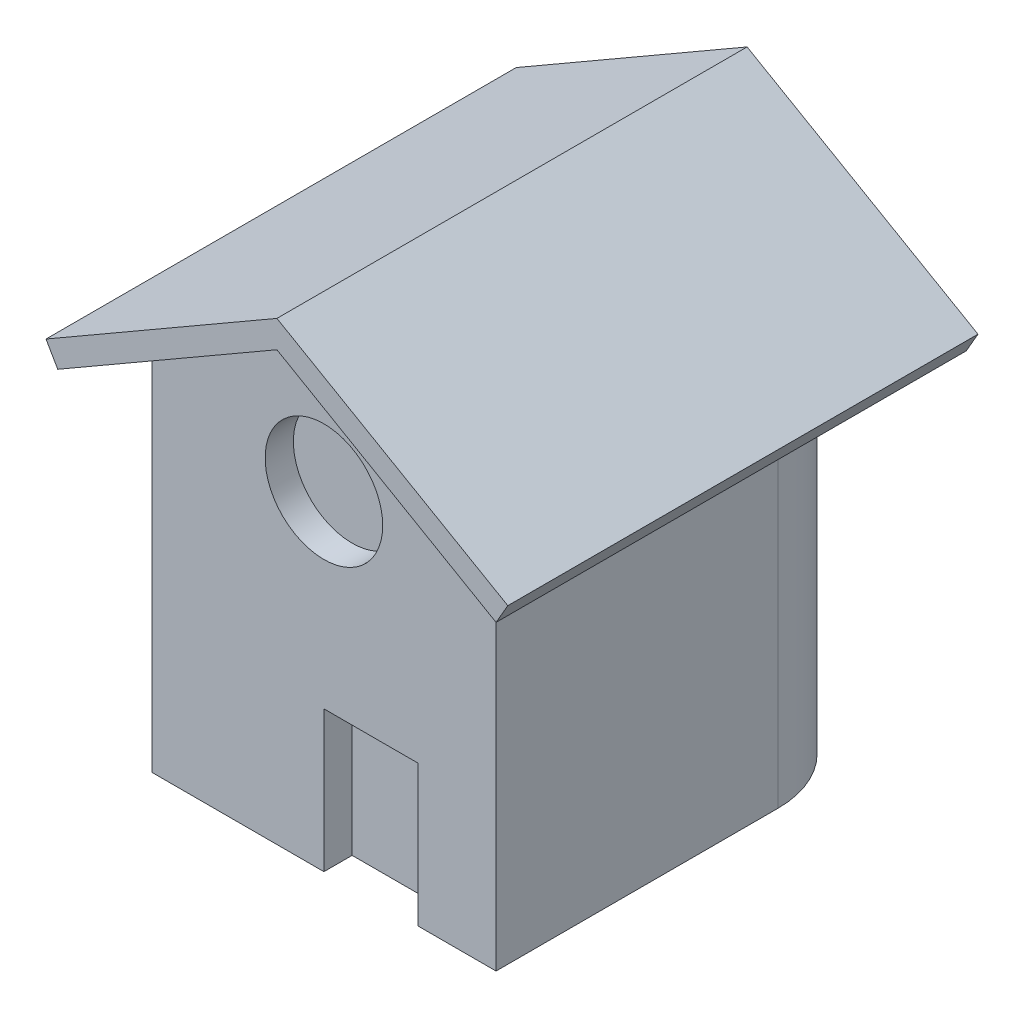
ISO-10303-21;
HEADER;
FILE_DESCRIPTION(('STEP AP214'),'2;1');
FILE_NAME('part.step','',(''),(''),'','','');
FILE_SCHEMA(('AUTOMOTIVE_DESIGN { 1 0 10303 214 1 1 1 1 }'));
ENDSEC;
DATA;
#1=APPLICATION_CONTEXT('core data for automotive mechanical design processes');
#2=APPLICATION_PROTOCOL_DEFINITION('international standard','automotive_design',2000,#1);
#3=PRODUCT_CONTEXT('',#1,'mechanical');
#4=PRODUCT('Part','Part','',(#3));
#5=PRODUCT_RELATED_PRODUCT_CATEGORY('part','',(#4));
#6=PRODUCT_DEFINITION_FORMATION('','',#4);
#7=PRODUCT_DEFINITION_CONTEXT('part definition',#1,'design');
#8=PRODUCT_DEFINITION('design','',#6,#7);
#9=PRODUCT_DEFINITION_SHAPE('','',#8);
#10=(LENGTH_UNIT() NAMED_UNIT(*) SI_UNIT(.MILLI.,.METRE.));
#11=(NAMED_UNIT(*) PLANE_ANGLE_UNIT() SI_UNIT($,.RADIAN.));
#12=(NAMED_UNIT(*) SI_UNIT($,.STERADIAN.) SOLID_ANGLE_UNIT());
#13=UNCERTAINTY_MEASURE_WITH_UNIT(LENGTH_MEASURE(1.E-05),#10,'distance_accuracy_value','');
#14=(GEOMETRIC_REPRESENTATION_CONTEXT(3) GLOBAL_UNCERTAINTY_ASSIGNED_CONTEXT((#13)) GLOBAL_UNIT_ASSIGNED_CONTEXT((#10,
#11,#12)) REPRESENTATION_CONTEXT('',''));
#15=CARTESIAN_POINT('',(0.,0.,0.));
#16=DIRECTION('',(0.,0.,1.));
#17=DIRECTION('',(1.,0.,0.));
#18=AXIS2_PLACEMENT_3D('',#15,#16,#17);
#19=CARTESIAN_POINT('',(-18.305,40.,20.));
#20=DIRECTION('',(1.,0.,0.));
#21=DIRECTION('',(0.,0.,-1.));
#22=AXIS2_PLACEMENT_3D('',#19,#20,#21);
#23=PLANE('',#22);
#24=DIRECTION('',(0.,0.,-1.));
#25=VECTOR('',#24,1.);
#26=CARTESIAN_POINT('',(-18.305,40.,20.));
#27=LINE('',#26,#25);
#28=CARTESIAN_POINT('',(-18.305,40.,20.));
#29=VERTEX_POINT('',#28);
#30=CARTESIAN_POINT('',(-18.305,40.,-10.));
#31=VERTEX_POINT('',#30);
#32=EDGE_CURVE('E234',#29,#31,#27,.T.);
#33=ORIENTED_EDGE('',*,*,#32,.T.);
#34=DIRECTION('',(0.,-1.,0.));
#35=VECTOR('',#34,1.);
#36=CARTESIAN_POINT('',(-18.305,40.,-10.));
#37=LINE('',#36,#35);
#38=CARTESIAN_POINT('',(-18.305,0.,-10.));
#39=VERTEX_POINT('',#38);
#40=EDGE_CURVE('E252',#31,#39,#37,.T.);
#41=ORIENTED_EDGE('',*,*,#40,.T.);
#42=DIRECTION('',(0.,0.,-1.));
#43=VECTOR('',#42,1.);
#44=CARTESIAN_POINT('',(-18.305,0.,20.));
#45=LINE('',#44,#43);
#46=CARTESIAN_POINT('',(-18.305,0.,20.));
#47=VERTEX_POINT('',#46);
#48=EDGE_CURVE('E249',#47,#39,#45,.T.);
#49=ORIENTED_EDGE('',*,*,#48,.F.);
#50=DIRECTION('',(0.,-1.,0.));
#51=VECTOR('',#50,1.);
#52=CARTESIAN_POINT('',(-18.305,40.,20.));
#53=LINE('',#52,#51);
#54=EDGE_CURVE('E221',#29,#47,#53,.T.);
#55=ORIENTED_EDGE('',*,*,#54,.F.);
#56=EDGE_LOOP('',(#33,#41,#49,#55));
#57=FACE_BOUND('',#56,.T.);
#58=ADVANCED_FACE('F35',(#57),#23,.F.);
#59=CARTESIAN_POINT('',(-18.305,0.,20.));
#60=DIRECTION('',(0.,1.,0.));
#61=DIRECTION('',(0.,0.,1.));
#62=AXIS2_PLACEMENT_3D('',#59,#60,#61);
#63=PLANE('',#62);
#64=ORIENTED_EDGE('',*,*,#48,.T.);
#65=CARTESIAN_POINT('',(-8.305,0.,-10.));
#66=DIRECTION('',(0.,1.,0.));
#67=DIRECTION('',(0.,0.,1.));
#68=AXIS2_PLACEMENT_3D('',#65,#66,#67);
#69=CIRCLE('',#68,10.);
#70=CARTESIAN_POINT('',(-8.305,0.,-20.));
#71=VERTEX_POINT('',#70);
#72=EDGE_CURVE('E257',#39,#71,#69,.F.);
#73=ORIENTED_EDGE('',*,*,#72,.T.);
#74=DIRECTION('',(1.,0.,0.));
#75=VECTOR('',#74,1.);
#76=CARTESIAN_POINT('',(-18.305,0.,-20.));
#77=LINE('',#76,#75);
#78=CARTESIAN_POINT('',(8.305,0.,-20.));
#79=VERTEX_POINT('',#78);
#80=EDGE_CURVE('E211',#71,#79,#77,.T.);
#81=ORIENTED_EDGE('',*,*,#80,.T.);
#82=CARTESIAN_POINT('',(8.30499999999999,0.,-10.));
#83=DIRECTION('',(0.,1.,0.));
#84=DIRECTION('',(0.,0.,1.));
#85=AXIS2_PLACEMENT_3D('',#82,#83,#84);
#86=CIRCLE('',#85,10.);
#87=CARTESIAN_POINT('',(18.305,0.,-10.));
#88=VERTEX_POINT('',#87);
#89=EDGE_CURVE('E255',#79,#88,#86,.F.);
#90=ORIENTED_EDGE('',*,*,#89,.T.);
#91=DIRECTION('',(0.,0.,-1.));
#92=VECTOR('',#91,1.);
#93=CARTESIAN_POINT('',(18.305,0.,20.));
#94=LINE('',#93,#92);
#95=CARTESIAN_POINT('',(18.305,0.,20.));
#96=VERTEX_POINT('',#95);
#97=EDGE_CURVE('E246',#96,#88,#94,.T.);
#98=ORIENTED_EDGE('',*,*,#97,.F.);
#99=DIRECTION('',(1.,0.,0.));
#100=VECTOR('',#99,1.);
#101=CARTESIAN_POINT('',(-18.305,0.,20.));
#102=LINE('',#101,#100);
#103=CARTESIAN_POINT('',(10.,0.,20.));
#104=VERTEX_POINT('',#103);
#105=EDGE_CURVE('E224',#104,#96,#102,.T.);
#106=ORIENTED_EDGE('',*,*,#105,.F.);
#107=DIRECTION('',(0.,0.,1.));
#108=VECTOR('',#107,1.);
#109=CARTESIAN_POINT('',(10.,0.,17.));
#110=LINE('',#109,#108);
#111=CARTESIAN_POINT('',(10.,0.,17.));
#112=VERTEX_POINT('',#111);
#113=EDGE_CURVE('E209',#112,#104,#110,.T.);
#114=ORIENTED_EDGE('',*,*,#113,.F.);
#115=DIRECTION('',(1.,0.,0.));
#116=VECTOR('',#115,1.);
#117=CARTESIAN_POINT('',(10.,0.,17.));
#118=LINE('',#117,#116);
#119=CARTESIAN_POINT('',(0.,0.,17.));
#120=VERTEX_POINT('',#119);
#121=EDGE_CURVE('E199',#120,#112,#118,.T.);
#122=ORIENTED_EDGE('',*,*,#121,.F.);
#123=DIRECTION('',(0.,0.,1.));
#124=VECTOR('',#123,1.);
#125=CARTESIAN_POINT('',(0.,0.,17.));
#126=LINE('',#125,#124);
#127=CARTESIAN_POINT('',(0.,0.,20.));
#128=VERTEX_POINT('',#127);
#129=EDGE_CURVE('E212',#120,#128,#126,.T.);
#130=ORIENTED_EDGE('',*,*,#129,.T.);
#131=EDGE_CURVE('E226',#47,#128,#102,.T.);
#132=ORIENTED_EDGE('',*,*,#131,.F.);
#133=EDGE_LOOP('',(#64,#73,#81,#90,#98,#106,#114,#122,#130,#132));
#134=FACE_BOUND('',#133,.T.);
#135=ADVANCED_FACE('F279',(#134),#63,.F.);
#136=CARTESIAN_POINT('',(18.305,0.,20.));
#137=DIRECTION('',(-1.,0.,0.));
#138=DIRECTION('',(0.,-1.,0.));
#139=AXIS2_PLACEMENT_3D('',#136,#137,#138);
#140=PLANE('',#139);
#141=ORIENTED_EDGE('',*,*,#97,.T.);
#142=DIRECTION('',(0.,1.,0.));
#143=VECTOR('',#142,1.);
#144=CARTESIAN_POINT('',(18.305,0.,-10.));
#145=LINE('',#144,#143);
#146=CARTESIAN_POINT('',(18.305,40.,-10.));
#147=VERTEX_POINT('',#146);
#148=EDGE_CURVE('E43',#88,#147,#145,.T.);
#149=ORIENTED_EDGE('',*,*,#148,.T.);
#150=DIRECTION('',(0.,0.,-1.));
#151=VECTOR('',#150,1.);
#152=CARTESIAN_POINT('',(18.305,40.,20.));
#153=LINE('',#152,#151);
#154=CARTESIAN_POINT('',(18.305,40.,20.));
#155=VERTEX_POINT('',#154);
#156=EDGE_CURVE('E243',#155,#147,#153,.T.);
#157=ORIENTED_EDGE('',*,*,#156,.F.);
#158=DIRECTION('',(0.,1.,0.));
#159=VECTOR('',#158,1.);
#160=CARTESIAN_POINT('',(18.305,0.,20.));
#161=LINE('',#160,#159);
#162=EDGE_CURVE('E229',#96,#155,#161,.T.);
#163=ORIENTED_EDGE('',*,*,#162,.F.);
#164=EDGE_LOOP('',(#141,#149,#157,#163));
#165=FACE_BOUND('',#164,.T.);
#166=ADVANCED_FACE('F266',(#165),#140,.F.);
#167=CARTESIAN_POINT('',(0.,0.,20.));
#168=DIRECTION('',(0.,0.,1.));
#169=DIRECTION('',(1.,0.,0.));
#170=AXIS2_PLACEMENT_3D('',#167,#168,#169);
#171=PLANE('',#170);
#172=DIRECTION('',(0.,1.,0.));
#173=VECTOR('',#172,1.);
#174=CARTESIAN_POINT('',(10.,0.,20.));
#175=LINE('',#174,#173);
#176=CARTESIAN_POINT('',(10.,15.,20.));
#177=VERTEX_POINT('',#176);
#178=EDGE_CURVE('E203',#104,#177,#175,.T.);
#179=ORIENTED_EDGE('',*,*,#178,.F.);
#180=ORIENTED_EDGE('',*,*,#105,.T.);
#181=ORIENTED_EDGE('',*,*,#162,.T.);
#182=DIRECTION('',(-0.866025403784438,0.500000000000001,0.));
#183=VECTOR('',#182,1.);
#184=CARTESIAN_POINT('',(18.305,40.,20.));
#185=LINE('',#184,#183);
#186=CARTESIAN_POINT('',(0.,50.5683966775161,20.));
#187=VERTEX_POINT('',#186);
#188=EDGE_CURVE('E231',#155,#187,#185,.T.);
#189=ORIENTED_EDGE('',*,*,#188,.T.);
#190=DIRECTION('',(-0.866025403784438,-0.500000000000001,0.));
#191=VECTOR('',#190,1.);
#192=CARTESIAN_POINT('',(0.,50.5683966775161,20.));
#193=LINE('',#192,#191);
#194=EDGE_CURVE('E179',#187,#29,#193,.T.);
#195=ORIENTED_EDGE('',*,*,#194,.T.);
#196=ORIENTED_EDGE('',*,*,#54,.T.);
#197=ORIENTED_EDGE('',*,*,#131,.T.);
#198=DIRECTION('',(0.,-1.,0.));
#199=VECTOR('',#198,1.);
#200=CARTESIAN_POINT('',(0.,0.,20.));
#201=LINE('',#200,#199);
#202=CARTESIAN_POINT('',(0.,15.,20.));
#203=VERTEX_POINT('',#202);
#204=EDGE_CURVE('E193',#203,#128,#201,.T.);
#205=ORIENTED_EDGE('',*,*,#204,.F.);
#206=DIRECTION('',(-1.,0.,0.));
#207=VECTOR('',#206,1.);
#208=CARTESIAN_POINT('',(10.,15.,20.));
#209=LINE('',#208,#207);
#210=EDGE_CURVE('E205',#177,#203,#209,.T.);
#211=ORIENTED_EDGE('',*,*,#210,.F.);
#212=EDGE_LOOP('',(#179,#180,#181,#189,#195,#196,#197,#205,#211));
#213=FACE_BOUND('',#212,.T.);
#214=CARTESIAN_POINT('',(0.,35.,20.));
#215=DIRECTION('',(0.,0.,1.));
#216=DIRECTION('',(1.,0.,0.));
#217=AXIS2_PLACEMENT_3D('',#214,#215,#216);
#218=CIRCLE('',#217,6.25);
#219=CARTESIAN_POINT('',(6.25,35.,20.));
#220=VERTEX_POINT('',#219);
#221=EDGE_CURVE('E180',#220,#220,#218,.T.);
#222=ORIENTED_EDGE('',*,*,#221,.F.);
#223=EDGE_LOOP('',(#222));
#224=FACE_BOUND('',#223,.T.);
#225=ADVANCED_FACE('F272',(#213,#224),#171,.T.);
#226=CARTESIAN_POINT('',(0.,0.,-20.));
#227=DIRECTION('',(0.,0.,1.));
#228=DIRECTION('',(1.,0.,0.));
#229=AXIS2_PLACEMENT_3D('',#226,#227,#228);
#230=PLANE('',#229);
#231=ORIENTED_EDGE('',*,*,#80,.F.);
#232=DIRECTION('',(0.,-1.,0.));
#233=VECTOR('',#232,1.);
#234=CARTESIAN_POINT('',(-8.305,0.,-20.));
#235=LINE('',#234,#233);
#236=CARTESIAN_POINT('',(-8.305,45.7735026918963,-20.));
#237=VERTEX_POINT('',#236);
#238=EDGE_CURVE('E56',#71,#237,#235,.F.);
#239=ORIENTED_EDGE('',*,*,#238,.T.);
#240=DIRECTION('',(-0.866025403784438,-0.500000000000001,0.));
#241=VECTOR('',#240,1.);
#242=CARTESIAN_POINT('',(0.,50.5683966775161,-20.));
#243=LINE('',#242,#241);
#244=CARTESIAN_POINT('',(0.,50.5683966775161,-20.));
#245=VERTEX_POINT('',#244);
#246=EDGE_CURVE('E225',#245,#237,#243,.T.);
#247=ORIENTED_EDGE('',*,*,#246,.F.);
#248=DIRECTION('',(-0.866025403784438,0.500000000000001,0.));
#249=VECTOR('',#248,1.);
#250=CARTESIAN_POINT('',(18.305,40.,-20.));
#251=LINE('',#250,#249);
#252=CARTESIAN_POINT('',(8.305,45.7735026918963,-20.));
#253=VERTEX_POINT('',#252);
#254=EDGE_CURVE('E237',#253,#245,#251,.T.);
#255=ORIENTED_EDGE('',*,*,#254,.F.);
#256=DIRECTION('',(0.,1.,0.));
#257=VECTOR('',#256,1.);
#258=CARTESIAN_POINT('',(8.30499999999999,0.,-20.));
#259=LINE('',#258,#257);
#260=EDGE_CURVE('E259',#253,#79,#259,.F.);
#261=ORIENTED_EDGE('',*,*,#260,.T.);
#262=EDGE_LOOP('',(#231,#239,#247,#255,#261));
#263=FACE_BOUND('',#262,.T.);
#264=ADVANCED_FACE('F281',(#263),#230,.F.);
#265=CARTESIAN_POINT('',(0.,35.,17.));
#266=DIRECTION('',(0.,0.,1.));
#267=DIRECTION('',(1.,0.,0.));
#268=AXIS2_PLACEMENT_3D('',#265,#266,#267);
#269=CYLINDRICAL_SURFACE('',#268,6.25);
#270=CARTESIAN_POINT('',(0.,35.,17.));
#271=DIRECTION('',(0.,0.,1.));
#272=DIRECTION('',(1.,0.,0.));
#273=AXIS2_PLACEMENT_3D('',#270,#271,#272);
#274=CIRCLE('',#273,6.25);
#275=CARTESIAN_POINT('',(6.25,35.,17.));
#276=VERTEX_POINT('',#275);
#277=EDGE_CURVE('E184',#276,#276,#274,.T.);
#278=ORIENTED_EDGE('',*,*,#277,.F.);
#279=EDGE_LOOP('',(#278));
#280=FACE_BOUND('',#279,.T.);
#281=ORIENTED_EDGE('',*,*,#221,.T.);
#282=EDGE_LOOP('',(#281));
#283=FACE_BOUND('',#282,.T.);
#284=ADVANCED_FACE('F379',(#280,#283),#269,.F.);
#285=CARTESIAN_POINT('',(0.,35.,17.));
#286=DIRECTION('',(0.,0.,1.));
#287=DIRECTION('',(1.,0.,0.));
#288=AXIS2_PLACEMENT_3D('',#285,#286,#287);
#289=PLANE('',#288);
#290=ORIENTED_EDGE('',*,*,#277,.T.);
#291=EDGE_LOOP('',(#290));
#292=FACE_BOUND('',#291,.T.);
#293=ADVANCED_FACE('F372',(#292),#289,.T.);
#294=CARTESIAN_POINT('',(10.,0.,17.));
#295=DIRECTION('',(1.,0.,0.));
#296=DIRECTION('',(0.,1.,0.));
#297=AXIS2_PLACEMENT_3D('',#294,#295,#296);
#298=PLANE('',#297);
#299=ORIENTED_EDGE('',*,*,#178,.T.);
#300=DIRECTION('',(0.,0.,1.));
#301=VECTOR('',#300,1.);
#302=CARTESIAN_POINT('',(10.,15.,17.));
#303=LINE('',#302,#301);
#304=CARTESIAN_POINT('',(10.,15.,17.));
#305=VERTEX_POINT('',#304);
#306=EDGE_CURVE('E202',#305,#177,#303,.T.);
#307=ORIENTED_EDGE('',*,*,#306,.F.);
#308=DIRECTION('',(0.,1.,0.));
#309=VECTOR('',#308,1.);
#310=CARTESIAN_POINT('',(10.,0.,17.));
#311=LINE('',#310,#309);
#312=EDGE_CURVE('E189',#112,#305,#311,.T.);
#313=ORIENTED_EDGE('',*,*,#312,.F.);
#314=ORIENTED_EDGE('',*,*,#113,.T.);
#315=EDGE_LOOP('',(#299,#307,#313,#314));
#316=FACE_BOUND('',#315,.T.);
#317=ADVANCED_FACE('F370',(#316),#298,.F.);
#318=CARTESIAN_POINT('',(0.,0.,17.));
#319=DIRECTION('',(-1.,0.,0.));
#320=DIRECTION('',(0.,0.,1.));
#321=AXIS2_PLACEMENT_3D('',#318,#319,#320);
#322=PLANE('',#321);
#323=ORIENTED_EDGE('',*,*,#204,.T.);
#324=ORIENTED_EDGE('',*,*,#129,.F.);
#325=DIRECTION('',(0.,-1.,0.));
#326=VECTOR('',#325,1.);
#327=CARTESIAN_POINT('',(0.,0.,17.));
#328=LINE('',#327,#326);
#329=CARTESIAN_POINT('',(0.,15.,17.));
#330=VERTEX_POINT('',#329);
#331=EDGE_CURVE('E196',#330,#120,#328,.T.);
#332=ORIENTED_EDGE('',*,*,#331,.F.);
#333=DIRECTION('',(0.,0.,1.));
#334=VECTOR('',#333,1.);
#335=CARTESIAN_POINT('',(0.,15.,17.));
#336=LINE('',#335,#334);
#337=EDGE_CURVE('E215',#330,#203,#336,.T.);
#338=ORIENTED_EDGE('',*,*,#337,.T.);
#339=EDGE_LOOP('',(#323,#324,#332,#338));
#340=FACE_BOUND('',#339,.T.);
#341=ADVANCED_FACE('F366',(#340),#322,.F.);
#342=CARTESIAN_POINT('',(10.,15.,17.));
#343=DIRECTION('',(0.,1.,0.));
#344=DIRECTION('',(-1.,0.,0.));
#345=AXIS2_PLACEMENT_3D('',#342,#343,#344);
#346=PLANE('',#345);
#347=ORIENTED_EDGE('',*,*,#210,.T.);
#348=ORIENTED_EDGE('',*,*,#337,.F.);
#349=DIRECTION('',(-1.,0.,0.));
#350=VECTOR('',#349,1.);
#351=CARTESIAN_POINT('',(10.,15.,17.));
#352=LINE('',#351,#350);
#353=EDGE_CURVE('E192',#305,#330,#352,.T.);
#354=ORIENTED_EDGE('',*,*,#353,.F.);
#355=ORIENTED_EDGE('',*,*,#306,.T.);
#356=EDGE_LOOP('',(#347,#348,#354,#355));
#357=FACE_BOUND('',#356,.T.);
#358=ADVANCED_FACE('F357',(#357),#346,.F.);
#359=CARTESIAN_POINT('',(0.,0.,17.));
#360=DIRECTION('',(0.,0.,1.));
#361=DIRECTION('',(1.,0.,0.));
#362=AXIS2_PLACEMENT_3D('',#359,#360,#361);
#363=PLANE('',#362);
#364=ORIENTED_EDGE('',*,*,#312,.T.);
#365=ORIENTED_EDGE('',*,*,#353,.T.);
#366=ORIENTED_EDGE('',*,*,#331,.T.);
#367=ORIENTED_EDGE('',*,*,#121,.T.);
#368=EDGE_LOOP('',(#364,#365,#366,#367));
#369=FACE_BOUND('',#368,.T.);
#370=ADVANCED_FACE('F351',(#369),#363,.T.);
#371=CARTESIAN_POINT('',(-8.305,40.,-10.));
#372=DIRECTION('',(0.,-1.,0.));
#373=DIRECTION('',(0.,0.,-1.));
#374=AXIS2_PLACEMENT_3D('',#371,#372,#373);
#375=CYLINDRICAL_SURFACE('',#374,10.);
#376=CARTESIAN_POINT('',(-8.305,45.7735026918963,-10.));
#377=DIRECTION('',(0.500000000000001,-0.866025403784438,0.));
#378=DIRECTION('',(-0.866025403784438,-0.500000000000001,0.));
#379=AXIS2_PLACEMENT_3D('',#376,#377,#378);
#380=ELLIPSE('',#379,11.5470053837925,10.);
#381=EDGE_CURVE('E262',#237,#31,#380,.F.);
#382=ORIENTED_EDGE('',*,*,#381,.F.);
#383=ORIENTED_EDGE('',*,*,#238,.F.);
#384=ORIENTED_EDGE('',*,*,#72,.F.);
#385=ORIENTED_EDGE('',*,*,#40,.F.);
#386=EDGE_LOOP('',(#382,#383,#384,#385));
#387=FACE_BOUND('',#386,.T.);
#388=ADVANCED_FACE('F349',(#387),#375,.T.);
#389=CARTESIAN_POINT('',(8.30499999999999,0.,-10.));
#390=DIRECTION('',(0.,1.,0.));
#391=DIRECTION('',(-1.,0.,0.));
#392=AXIS2_PLACEMENT_3D('',#389,#390,#391);
#393=CYLINDRICAL_SURFACE('',#392,10.);
#394=ORIENTED_EDGE('',*,*,#89,.F.);
#395=ORIENTED_EDGE('',*,*,#260,.F.);
#396=CARTESIAN_POINT('',(8.305,45.7735026918963,-10.));
#397=DIRECTION('',(-0.500000000000001,-0.866025403784438,0.));
#398=DIRECTION('',(-0.866025403784438,0.500000000000001,0.));
#399=AXIS2_PLACEMENT_3D('',#396,#397,#398);
#400=ELLIPSE('',#399,11.5470053837925,10.);
#401=EDGE_CURVE('E11',#147,#253,#400,.F.);
#402=ORIENTED_EDGE('',*,*,#401,.F.);
#403=ORIENTED_EDGE('',*,*,#148,.F.);
#404=EDGE_LOOP('',(#394,#395,#402,#403));
#405=FACE_BOUND('',#404,.T.);
#406=ADVANCED_FACE('F37',(#405),#393,.T.);
#407=CARTESIAN_POINT('',(-23.305,37.1132486540519,25.));
#408=DIRECTION('',(-0.5,0.866025403784439,0.));
#409=DIRECTION('',(-0.866025403784439,-0.5,0.));
#410=AXIS2_PLACEMENT_3D('',#407,#408,#409);
#411=PLANE('',#410);
#412=ORIENTED_EDGE('',*,*,#194,.F.);
#413=DIRECTION('',(0.,0.,-1.));
#414=VECTOR('',#413,1.);
#415=CARTESIAN_POINT('',(0.,50.5683966775161,25.));
#416=LINE('',#415,#414);
#417=CARTESIAN_POINT('',(0.,50.5683966775161,25.));
#418=VERTEX_POINT('',#417);
#419=EDGE_CURVE('E159',#418,#187,#416,.T.);
#420=ORIENTED_EDGE('',*,*,#419,.F.);
#421=DIRECTION('',(0.866025403784439,0.5,0.));
#422=VECTOR('',#421,1.);
#423=CARTESIAN_POINT('',(-23.305,37.1132486540519,25.));
#424=LINE('',#423,#422);
#425=CARTESIAN_POINT('',(-23.305,37.1132486540519,25.));
#426=VERTEX_POINT('',#425);
#427=EDGE_CURVE('E165',#426,#418,#424,.T.);
#428=ORIENTED_EDGE('',*,*,#427,.F.);
#429=DIRECTION('',(0.,0.,-1.));
#430=VECTOR('',#429,1.);
#431=CARTESIAN_POINT('',(-23.305,37.1132486540519,25.));
#432=LINE('',#431,#430);
#433=CARTESIAN_POINT('',(-23.305,37.1132486540519,-25.));
#434=VERTEX_POINT('',#433);
#435=EDGE_CURVE('E287',#426,#434,#432,.T.);
#436=ORIENTED_EDGE('',*,*,#435,.T.);
#437=DIRECTION('',(0.866025403784439,0.5,0.));
#438=VECTOR('',#437,1.);
#439=CARTESIAN_POINT('',(-23.305,37.1132486540519,-25.));
#440=LINE('',#439,#438);
#441=CARTESIAN_POINT('',(0.,50.5683966775161,-25.));
#442=VERTEX_POINT('',#441);
#443=EDGE_CURVE('E286',#434,#442,#440,.T.);
#444=ORIENTED_EDGE('',*,*,#443,.T.);
#445=EDGE_CURVE('E181',#245,#442,#416,.T.);
#446=ORIENTED_EDGE('',*,*,#445,.F.);
#447=ORIENTED_EDGE('',*,*,#246,.T.);
#448=ORIENTED_EDGE('',*,*,#381,.T.);
#449=ORIENTED_EDGE('',*,*,#32,.F.);
#450=EDGE_LOOP('',(#412,#420,#428,#436,#444,#446,#447,#448,#449));
#451=FACE_BOUND('',#450,.T.);
#452=ADVANCED_FACE('F177',(#451),#411,.F.);
#453=CARTESIAN_POINT('',(0.,50.5683966775161,25.));
#454=DIRECTION('',(0.5,0.866025403784438,0.));
#455=DIRECTION('',(-0.866025403784438,0.5,0.));
#456=AXIS2_PLACEMENT_3D('',#453,#454,#455);
#457=PLANE('',#456);
#458=ORIENTED_EDGE('',*,*,#188,.F.);
#459=ORIENTED_EDGE('',*,*,#156,.T.);
#460=ORIENTED_EDGE('',*,*,#401,.T.);
#461=ORIENTED_EDGE('',*,*,#254,.T.);
#462=ORIENTED_EDGE('',*,*,#445,.T.);
#463=DIRECTION('',(0.866025403784438,-0.5,0.));
#464=VECTOR('',#463,1.);
#465=CARTESIAN_POINT('',(0.,50.5683966775161,-25.));
#466=LINE('',#465,#464);
#467=CARTESIAN_POINT('',(23.305,37.1132486540519,-25.));
#468=VERTEX_POINT('',#467);
#469=EDGE_CURVE('E290',#442,#468,#466,.T.);
#470=ORIENTED_EDGE('',*,*,#469,.T.);
#471=DIRECTION('',(0.,0.,-1.));
#472=VECTOR('',#471,1.);
#473=CARTESIAN_POINT('',(23.305,37.1132486540519,25.));
#474=LINE('',#473,#472);
#475=CARTESIAN_POINT('',(23.305,37.1132486540519,25.));
#476=VERTEX_POINT('',#475);
#477=EDGE_CURVE('E161',#476,#468,#474,.T.);
#478=ORIENTED_EDGE('',*,*,#477,.F.);
#479=DIRECTION('',(0.866025403784438,-0.5,0.));
#480=VECTOR('',#479,1.);
#481=CARTESIAN_POINT('',(0.,50.5683966775161,25.));
#482=LINE('',#481,#480);
#483=EDGE_CURVE('E154',#418,#476,#482,.T.);
#484=ORIENTED_EDGE('',*,*,#483,.F.);
#485=ORIENTED_EDGE('',*,*,#419,.T.);
#486=EDGE_LOOP('',(#458,#459,#460,#461,#462,#470,#478,#484,#485));
#487=FACE_BOUND('',#486,.T.);
#488=ADVANCED_FACE('F157',(#487),#457,.F.);
#489=CARTESIAN_POINT('',(23.305,37.1132486540519,25.));
#490=DIRECTION('',(-0.866025403784439,0.5,0.));
#491=DIRECTION('',(-0.5,-0.866025403784439,0.));
#492=AXIS2_PLACEMENT_3D('',#489,#490,#491);
#493=PLANE('',#492);
#494=DIRECTION('',(0.5,0.866025403784439,0.));
#495=VECTOR('',#494,1.);
#496=CARTESIAN_POINT('',(23.305,37.1132486540519,-25.));
#497=LINE('',#496,#495);
#498=CARTESIAN_POINT('',(24.555,39.278312163513,-25.));
#499=VERTEX_POINT('',#498);
#500=EDGE_CURVE('E292',#468,#499,#497,.T.);
#501=ORIENTED_EDGE('',*,*,#500,.T.);
#502=DIRECTION('',(0.,0.,-1.));
#503=VECTOR('',#502,1.);
#504=CARTESIAN_POINT('',(24.555,39.278312163513,25.));
#505=LINE('',#504,#503);
#506=CARTESIAN_POINT('',(24.555,39.278312163513,25.));
#507=VERTEX_POINT('',#506);
#508=EDGE_CURVE('E309',#507,#499,#505,.T.);
#509=ORIENTED_EDGE('',*,*,#508,.F.);
#510=DIRECTION('',(0.5,0.866025403784439,0.));
#511=VECTOR('',#510,1.);
#512=CARTESIAN_POINT('',(23.305,37.1132486540519,25.));
#513=LINE('',#512,#511);
#514=EDGE_CURVE('E164',#476,#507,#513,.T.);
#515=ORIENTED_EDGE('',*,*,#514,.F.);
#516=ORIENTED_EDGE('',*,*,#477,.T.);
#517=EDGE_LOOP('',(#501,#509,#515,#516));
#518=FACE_BOUND('',#517,.T.);
#519=ADVANCED_FACE('F317',(#518),#493,.F.);
#520=CARTESIAN_POINT('',(24.555,39.278312163513,25.));
#521=DIRECTION('',(-0.5,-0.866025403784439,0.));
#522=DIRECTION('',(0.866025403784439,-0.5,0.));
#523=AXIS2_PLACEMENT_3D('',#520,#521,#522);
#524=PLANE('',#523);
#525=DIRECTION('',(-0.866025403784439,0.5,0.));
#526=VECTOR('',#525,1.);
#527=CARTESIAN_POINT('',(24.555,39.278312163513,-25.));
#528=LINE('',#527,#526);
#529=CARTESIAN_POINT('',(0.,53.4551480234642,-25.));
#530=VERTEX_POINT('',#529);
#531=EDGE_CURVE('E298',#499,#530,#528,.T.);
#532=ORIENTED_EDGE('',*,*,#531,.T.);
#533=DIRECTION('',(0.,0.,-1.));
#534=VECTOR('',#533,1.);
#535=CARTESIAN_POINT('',(0.,53.4551480234642,25.));
#536=LINE('',#535,#534);
#537=CARTESIAN_POINT('',(0.,53.4551480234642,25.));
#538=VERTEX_POINT('',#537);
#539=EDGE_CURVE('E307',#538,#530,#536,.T.);
#540=ORIENTED_EDGE('',*,*,#539,.F.);
#541=DIRECTION('',(-0.866025403784439,0.5,0.));
#542=VECTOR('',#541,1.);
#543=CARTESIAN_POINT('',(24.555,39.278312163513,25.));
#544=LINE('',#543,#542);
#545=EDGE_CURVE('E327',#507,#538,#544,.T.);
#546=ORIENTED_EDGE('',*,*,#545,.F.);
#547=ORIENTED_EDGE('',*,*,#508,.T.);
#548=EDGE_LOOP('',(#532,#540,#546,#547));
#549=FACE_BOUND('',#548,.T.);
#550=ADVANCED_FACE('F321',(#549),#524,.F.);
#551=CARTESIAN_POINT('',(0.,53.4551480234642,25.));
#552=DIRECTION('',(0.5,-0.866025403784439,0.));
#553=DIRECTION('',(0.866025403784439,0.5,0.));
#554=AXIS2_PLACEMENT_3D('',#551,#552,#553);
#555=PLANE('',#554);
#556=DIRECTION('',(-0.866025403784439,-0.5,0.));
#557=VECTOR('',#556,1.);
#558=CARTESIAN_POINT('',(0.,53.4551480234642,-25.));
#559=LINE('',#558,#557);
#560=CARTESIAN_POINT('',(-24.555,39.278312163513,-25.));
#561=VERTEX_POINT('',#560);
#562=EDGE_CURVE('E300',#530,#561,#559,.T.);
#563=ORIENTED_EDGE('',*,*,#562,.T.);
#564=DIRECTION('',(0.,0.,-1.));
#565=VECTOR('',#564,1.);
#566=CARTESIAN_POINT('',(-24.555,39.278312163513,25.));
#567=LINE('',#566,#565);
#568=CARTESIAN_POINT('',(-24.555,39.278312163513,25.));
#569=VERTEX_POINT('',#568);
#570=EDGE_CURVE('E304',#569,#561,#567,.T.);
#571=ORIENTED_EDGE('',*,*,#570,.F.);
#572=DIRECTION('',(-0.866025403784439,-0.5,0.));
#573=VECTOR('',#572,1.);
#574=CARTESIAN_POINT('',(0.,53.4551480234642,25.));
#575=LINE('',#574,#573);
#576=EDGE_CURVE('E326',#538,#569,#575,.T.);
#577=ORIENTED_EDGE('',*,*,#576,.F.);
#578=ORIENTED_EDGE('',*,*,#539,.T.);
#579=EDGE_LOOP('',(#563,#571,#577,#578));
#580=FACE_BOUND('',#579,.T.);
#581=ADVANCED_FACE('F324',(#580),#555,.F.);
#582=CARTESIAN_POINT('',(-24.555,39.278312163513,25.));
#583=DIRECTION('',(0.866025403784439,0.5,0.));
#584=DIRECTION('',(-0.5,0.866025403784439,0.));
#585=AXIS2_PLACEMENT_3D('',#582,#583,#584);
#586=PLANE('',#585);
#587=DIRECTION('',(0.5,-0.866025403784439,0.));
#588=VECTOR('',#587,1.);
#589=CARTESIAN_POINT('',(-24.555,39.278312163513,-25.));
#590=LINE('',#589,#588);
#591=EDGE_CURVE('E174',#561,#434,#590,.T.);
#592=ORIENTED_EDGE('',*,*,#591,.T.);
#593=ORIENTED_EDGE('',*,*,#435,.F.);
#594=DIRECTION('',(0.5,-0.866025403784439,0.));
#595=VECTOR('',#594,1.);
#596=CARTESIAN_POINT('',(-24.555,39.278312163513,25.));
#597=LINE('',#596,#595);
#598=EDGE_CURVE('E170',#569,#426,#597,.T.);
#599=ORIENTED_EDGE('',*,*,#598,.F.);
#600=ORIENTED_EDGE('',*,*,#570,.T.);
#601=EDGE_LOOP('',(#592,#593,#599,#600));
#602=FACE_BOUND('',#601,.T.);
#603=ADVANCED_FACE('F331',(#602),#586,.F.);
#604=CARTESIAN_POINT('',(0.,0.,25.));
#605=DIRECTION('',(0.,0.,-1.));
#606=DIRECTION('',(-1.,0.,0.));
#607=AXIS2_PLACEMENT_3D('',#604,#605,#606);
#608=PLANE('',#607);
#609=ORIENTED_EDGE('',*,*,#427,.T.);
#610=ORIENTED_EDGE('',*,*,#483,.T.);
#611=ORIENTED_EDGE('',*,*,#514,.T.);
#612=ORIENTED_EDGE('',*,*,#545,.T.);
#613=ORIENTED_EDGE('',*,*,#576,.T.);
#614=ORIENTED_EDGE('',*,*,#598,.T.);
#615=EDGE_LOOP('',(#609,#610,#611,#612,#613,#614));
#616=FACE_BOUND('',#615,.T.);
#617=ADVANCED_FACE('F168',(#616),#608,.F.);
#618=CARTESIAN_POINT('',(0.,0.,-25.));
#619=DIRECTION('',(0.,0.,-1.));
#620=DIRECTION('',(-1.,0.,0.));
#621=AXIS2_PLACEMENT_3D('',#618,#619,#620);
#622=PLANE('',#621);
#623=ORIENTED_EDGE('',*,*,#443,.F.);
#624=ORIENTED_EDGE('',*,*,#591,.F.);
#625=ORIENTED_EDGE('',*,*,#562,.F.);
#626=ORIENTED_EDGE('',*,*,#531,.F.);
#627=ORIENTED_EDGE('',*,*,#500,.F.);
#628=ORIENTED_EDGE('',*,*,#469,.F.);
#629=EDGE_LOOP('',(#623,#624,#625,#626,#627,#628));
#630=FACE_BOUND('',#629,.T.);
#631=ADVANCED_FACE('F318',(#630),#622,.T.);
#632=CLOSED_SHELL('',(#58,#135,#166,#225,#264,#284,#293,#317,#341,#358,#370,#388,#406,#452,#488,
#519,#550,#581,#603,#617,#631));
#633=MANIFOLD_SOLID_BREP('B2',#632);
#634=ADVANCED_BREP_SHAPE_REPRESENTATION('',(#18,#633),#14);
#635=SHAPE_DEFINITION_REPRESENTATION(#9,#634);
ENDSEC;
END-ISO-10303-21;
